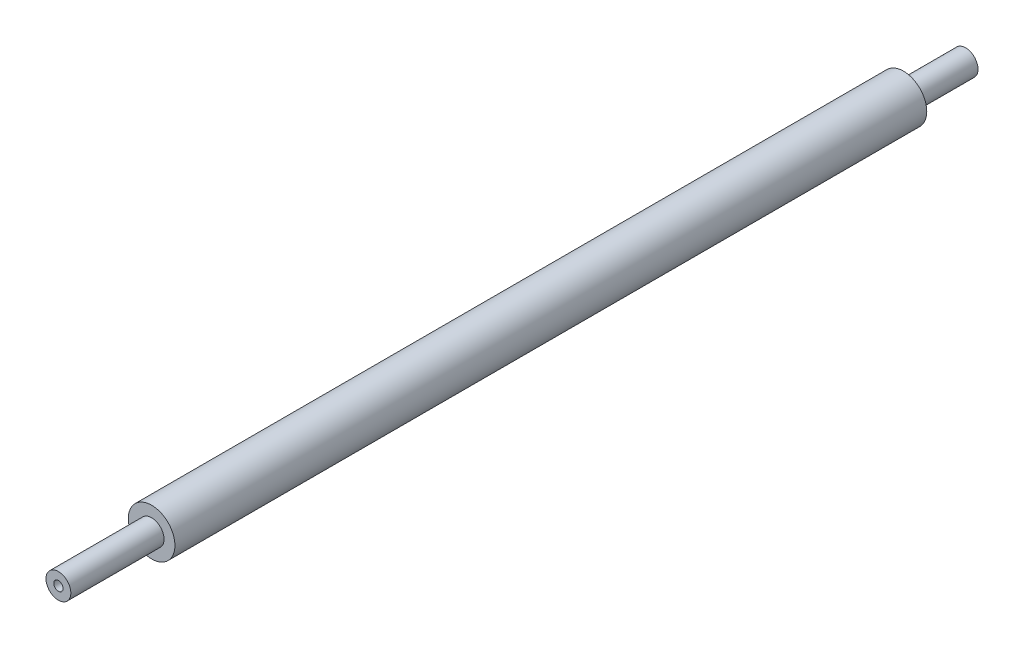
ISO-10303-21;
HEADER;
FILE_DESCRIPTION(('STEP AP214'),'2;1');
FILE_NAME('part.step','',(''),(''),'','','');
FILE_SCHEMA(('AUTOMOTIVE_DESIGN { 1 0 10303 214 1 1 1 1 }'));
ENDSEC;
DATA;
#1=APPLICATION_CONTEXT('core data for automotive mechanical design processes');
#2=APPLICATION_PROTOCOL_DEFINITION('international standard','automotive_design',2000,#1);
#3=PRODUCT_CONTEXT('',#1,'mechanical');
#4=PRODUCT('Part','Part','',(#3));
#5=PRODUCT_RELATED_PRODUCT_CATEGORY('part','',(#4));
#6=PRODUCT_DEFINITION_FORMATION('','',#4);
#7=PRODUCT_DEFINITION_CONTEXT('part definition',#1,'design');
#8=PRODUCT_DEFINITION('design','',#6,#7);
#9=PRODUCT_DEFINITION_SHAPE('','',#8);
#10=(LENGTH_UNIT() NAMED_UNIT(*) SI_UNIT(.MILLI.,.METRE.));
#11=(NAMED_UNIT(*) PLANE_ANGLE_UNIT() SI_UNIT($,.RADIAN.));
#12=(NAMED_UNIT(*) SI_UNIT($,.STERADIAN.) SOLID_ANGLE_UNIT());
#13=UNCERTAINTY_MEASURE_WITH_UNIT(LENGTH_MEASURE(1.E-05),#10,'distance_accuracy_value','');
#14=(GEOMETRIC_REPRESENTATION_CONTEXT(3) GLOBAL_UNCERTAINTY_ASSIGNED_CONTEXT((#13)) GLOBAL_UNIT_ASSIGNED_CONTEXT((#10,
#11,#12)) REPRESENTATION_CONTEXT('',''));
#15=CARTESIAN_POINT('',(0.,0.,0.));
#16=DIRECTION('',(0.,0.,1.));
#17=DIRECTION('',(1.,0.,0.));
#18=AXIS2_PLACEMENT_3D('',#15,#16,#17);
#19=CARTESIAN_POINT('',(0.,0.,242.));
#20=DIRECTION('',(0.,0.,-1.));
#21=DIRECTION('',(-1.,0.,0.));
#22=AXIS2_PLACEMENT_3D('',#19,#20,#21);
#23=CYLINDRICAL_SURFACE('',#22,7.5);
#24=CARTESIAN_POINT('',(0.,0.,242.));
#25=DIRECTION('',(0.,0.,1.));
#26=DIRECTION('',(1.,0.,0.));
#27=AXIS2_PLACEMENT_3D('',#24,#25,#26);
#28=CIRCLE('',#27,7.5);
#29=CARTESIAN_POINT('',(7.5,0.,242.));
#30=VERTEX_POINT('',#29);
#31=EDGE_CURVE('E43',#30,#30,#28,.T.);
#32=ORIENTED_EDGE('',*,*,#31,.F.);
#33=EDGE_LOOP('',(#32));
#34=FACE_BOUND('',#33,.T.);
#35=CARTESIAN_POINT('',(0.,0.,0.));
#36=DIRECTION('',(0.,0.,1.));
#37=DIRECTION('',(1.,0.,0.));
#38=AXIS2_PLACEMENT_3D('',#35,#36,#37);
#39=CIRCLE('',#38,7.5);
#40=CARTESIAN_POINT('',(7.5,0.,0.));
#41=VERTEX_POINT('',#40);
#42=EDGE_CURVE('E34',#41,#41,#39,.T.);
#43=ORIENTED_EDGE('',*,*,#42,.T.);
#44=EDGE_LOOP('',(#43));
#45=FACE_BOUND('',#44,.T.);
#46=ADVANCED_FACE('F31',(#34,#45),#23,.T.);
#47=CARTESIAN_POINT('',(0.,0.,242.));
#48=DIRECTION('',(0.,0.,1.));
#49=DIRECTION('',(1.,0.,0.));
#50=AXIS2_PLACEMENT_3D('',#47,#48,#49);
#51=PLANE('',#50);
#52=CARTESIAN_POINT('',(0.,0.,242.));
#53=DIRECTION('',(0.,0.,1.));
#54=DIRECTION('',(1.,0.,0.));
#55=AXIS2_PLACEMENT_3D('',#52,#53,#54);
#56=CIRCLE('',#55,4.);
#57=CARTESIAN_POINT('',(4.,0.,242.));
#58=VERTEX_POINT('',#57);
#59=EDGE_CURVE('E38',#58,#58,#56,.T.);
#60=ORIENTED_EDGE('',*,*,#59,.F.);
#61=EDGE_LOOP('',(#60));
#62=FACE_BOUND('',#61,.T.);
#63=ORIENTED_EDGE('',*,*,#31,.T.);
#64=EDGE_LOOP('',(#63));
#65=FACE_BOUND('',#64,.T.);
#66=ADVANCED_FACE('F61',(#62,#65),#51,.T.);
#67=CARTESIAN_POINT('',(0.,0.,0.));
#68=DIRECTION('',(0.,0.,1.));
#69=DIRECTION('',(1.,0.,0.));
#70=AXIS2_PLACEMENT_3D('',#67,#68,#69);
#71=PLANE('',#70);
#72=CARTESIAN_POINT('',(0.,0.,0.));
#73=DIRECTION('',(0.,0.,-1.));
#74=DIRECTION('',(-1.,0.,0.));
#75=AXIS2_PLACEMENT_3D('',#72,#73,#74);
#76=CIRCLE('',#75,4.);
#77=CARTESIAN_POINT('',(-4.,0.,0.));
#78=VERTEX_POINT('',#77);
#79=EDGE_CURVE('E10',#78,#78,#76,.T.);
#80=ORIENTED_EDGE('',*,*,#79,.F.);
#81=EDGE_LOOP('',(#80));
#82=FACE_BOUND('',#81,.T.);
#83=ORIENTED_EDGE('',*,*,#42,.F.);
#84=EDGE_LOOP('',(#83));
#85=FACE_BOUND('',#84,.T.);
#86=ADVANCED_FACE('F58',(#82,#85),#71,.F.);
#87=CARTESIAN_POINT('',(0.,0.,272.));
#88=DIRECTION('',(0.,0.,-1.));
#89=DIRECTION('',(-1.,0.,0.));
#90=AXIS2_PLACEMENT_3D('',#87,#88,#89);
#91=CYLINDRICAL_SURFACE('',#90,4.);
#92=CARTESIAN_POINT('',(0.,0.,272.));
#93=DIRECTION('',(0.,0.,1.));
#94=DIRECTION('',(1.,0.,0.));
#95=AXIS2_PLACEMENT_3D('',#92,#93,#94);
#96=CIRCLE('',#95,4.);
#97=CARTESIAN_POINT('',(4.,0.,272.));
#98=VERTEX_POINT('',#97);
#99=EDGE_CURVE('E49',#98,#98,#96,.T.);
#100=ORIENTED_EDGE('',*,*,#99,.F.);
#101=EDGE_LOOP('',(#100));
#102=FACE_BOUND('',#101,.T.);
#103=ORIENTED_EDGE('',*,*,#59,.T.);
#104=EDGE_LOOP('',(#103));
#105=FACE_BOUND('',#104,.T.);
#106=ADVANCED_FACE('F60',(#102,#105),#91,.T.);
#107=CARTESIAN_POINT('',(0.,0.,272.));
#108=DIRECTION('',(0.,0.,1.));
#109=DIRECTION('',(1.,0.,0.));
#110=AXIS2_PLACEMENT_3D('',#107,#108,#109);
#111=PLANE('',#110);
#112=CARTESIAN_POINT('',(0.,0.,272.));
#113=DIRECTION('',(0.,0.,1.));
#114=DIRECTION('',(1.,0.,0.));
#115=AXIS2_PLACEMENT_3D('',#112,#113,#114);
#116=CIRCLE('',#115,1.5);
#117=CARTESIAN_POINT('',(1.5,0.,272.));
#118=VERTEX_POINT('',#117);
#119=EDGE_CURVE('E146',#118,#118,#116,.T.);
#120=ORIENTED_EDGE('',*,*,#119,.F.);
#121=EDGE_LOOP('',(#120));
#122=FACE_BOUND('',#121,.T.);
#123=ORIENTED_EDGE('',*,*,#99,.T.);
#124=EDGE_LOOP('',(#123));
#125=FACE_BOUND('',#124,.T.);
#126=ADVANCED_FACE('F67',(#122,#125),#111,.T.);
#127=CARTESIAN_POINT('',(0.,0.,-20.));
#128=DIRECTION('',(0.,0.,1.));
#129=DIRECTION('',(1.,0.,0.));
#130=AXIS2_PLACEMENT_3D('',#127,#128,#129);
#131=CYLINDRICAL_SURFACE('',#130,4.);
#132=CARTESIAN_POINT('',(0.,0.,-20.));
#133=DIRECTION('',(0.,0.,-1.));
#134=DIRECTION('',(-1.,0.,0.));
#135=AXIS2_PLACEMENT_3D('',#132,#133,#134);
#136=CIRCLE('',#135,4.);
#137=CARTESIAN_POINT('',(-4.,0.,-20.));
#138=VERTEX_POINT('',#137);
#139=EDGE_CURVE('E47',#138,#138,#136,.T.);
#140=ORIENTED_EDGE('',*,*,#139,.F.);
#141=EDGE_LOOP('',(#140));
#142=FACE_BOUND('',#141,.T.);
#143=ORIENTED_EDGE('',*,*,#79,.T.);
#144=EDGE_LOOP('',(#143));
#145=FACE_BOUND('',#144,.T.);
#146=ADVANCED_FACE('F97',(#142,#145),#131,.T.);
#147=CARTESIAN_POINT('',(0.,0.,-20.));
#148=DIRECTION('',(0.,0.,-1.));
#149=DIRECTION('',(-1.,0.,0.));
#150=AXIS2_PLACEMENT_3D('',#147,#148,#149);
#151=PLANE('',#150);
#152=ORIENTED_EDGE('',*,*,#139,.T.);
#153=EDGE_LOOP('',(#152));
#154=FACE_BOUND('',#153,.T.);
#155=ADVANCED_FACE('F102',(#154),#151,.T.);
#156=CARTESIAN_POINT('',(0.,0.,264.));
#157=DIRECTION('',(0.,0.,1.));
#158=DIRECTION('',(1.,0.,0.));
#159=AXIS2_PLACEMENT_3D('',#156,#157,#158);
#160=CYLINDRICAL_SURFACE('',#159,1.5);
#161=CARTESIAN_POINT('',(0.,0.,264.));
#162=DIRECTION('',(0.,0.,1.));
#163=DIRECTION('',(1.,0.,0.));
#164=AXIS2_PLACEMENT_3D('',#161,#162,#163);
#165=CIRCLE('',#164,1.5);
#166=CARTESIAN_POINT('',(1.5,0.,264.));
#167=VERTEX_POINT('',#166);
#168=EDGE_CURVE('E145',#167,#167,#165,.T.);
#169=ORIENTED_EDGE('',*,*,#168,.F.);
#170=EDGE_LOOP('',(#169));
#171=FACE_BOUND('',#170,.T.);
#172=ORIENTED_EDGE('',*,*,#119,.T.);
#173=EDGE_LOOP('',(#172));
#174=FACE_BOUND('',#173,.T.);
#175=ADVANCED_FACE('F112',(#171,#174),#160,.F.);
#176=CARTESIAN_POINT('',(0.,0.,264.));
#177=DIRECTION('',(0.,0.,1.));
#178=DIRECTION('',(1.,0.,0.));
#179=AXIS2_PLACEMENT_3D('',#176,#177,#178);
#180=PLANE('',#179);
#181=ORIENTED_EDGE('',*,*,#168,.T.);
#182=EDGE_LOOP('',(#181));
#183=FACE_BOUND('',#182,.T.);
#184=ADVANCED_FACE('F129',(#183),#180,.T.);
#185=CLOSED_SHELL('',(#46,#66,#86,#106,#126,#146,#155,#175,#184));
#186=MANIFOLD_SOLID_BREP('B2',#185);
#187=ADVANCED_BREP_SHAPE_REPRESENTATION('',(#18,#186),#14);
#188=SHAPE_DEFINITION_REPRESENTATION(#9,#187);
ENDSEC;
END-ISO-10303-21;
